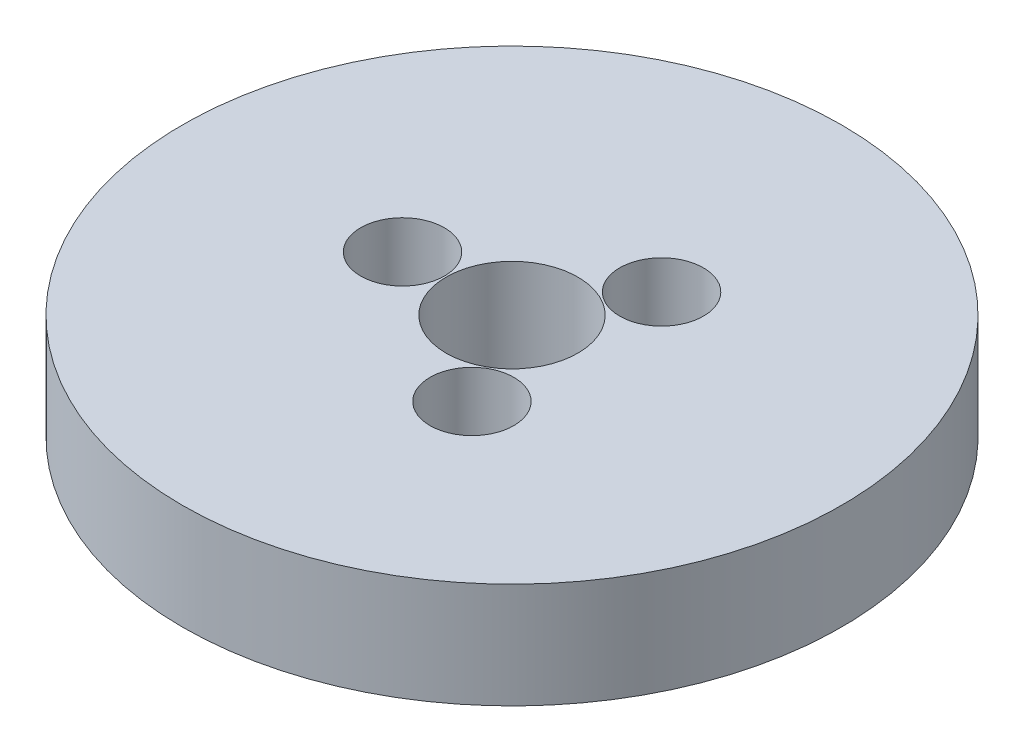
ISO-10303-21;
HEADER;
FILE_DESCRIPTION(('STEP AP214'),'2;1');
FILE_NAME('part.step','',(''),(''),'','','');
FILE_SCHEMA(('AUTOMOTIVE_DESIGN { 1 0 10303 214 1 1 1 1 }'));
ENDSEC;
DATA;
#1=APPLICATION_CONTEXT('core data for automotive mechanical design processes');
#2=APPLICATION_PROTOCOL_DEFINITION('international standard','automotive_design',2000,#1);
#3=PRODUCT_CONTEXT('',#1,'mechanical');
#4=PRODUCT('Part','Part','',(#3));
#5=PRODUCT_RELATED_PRODUCT_CATEGORY('part','',(#4));
#6=PRODUCT_DEFINITION_FORMATION('','',#4);
#7=PRODUCT_DEFINITION_CONTEXT('part definition',#1,'design');
#8=PRODUCT_DEFINITION('design','',#6,#7);
#9=PRODUCT_DEFINITION_SHAPE('','',#8);
#10=(LENGTH_UNIT() NAMED_UNIT(*) SI_UNIT(.MILLI.,.METRE.));
#11=(NAMED_UNIT(*) PLANE_ANGLE_UNIT() SI_UNIT($,.RADIAN.));
#12=(NAMED_UNIT(*) SI_UNIT($,.STERADIAN.) SOLID_ANGLE_UNIT());
#13=UNCERTAINTY_MEASURE_WITH_UNIT(LENGTH_MEASURE(1.E-05),#10,'distance_accuracy_value','');
#14=(GEOMETRIC_REPRESENTATION_CONTEXT(3) GLOBAL_UNCERTAINTY_ASSIGNED_CONTEXT((#13)) GLOBAL_UNIT_ASSIGNED_CONTEXT((#10,
#11,#12)) REPRESENTATION_CONTEXT('',''));
#15=CARTESIAN_POINT('',(0.,0.,0.));
#16=DIRECTION('',(0.,0.,1.));
#17=DIRECTION('',(1.,0.,0.));
#18=AXIS2_PLACEMENT_3D('',#15,#16,#17);
#19=CARTESIAN_POINT('',(0.,16.,0.));
#20=DIRECTION('',(0.,-1.,0.));
#21=DIRECTION('',(0.,0.,-1.));
#22=AXIS2_PLACEMENT_3D('',#19,#20,#21);
#23=CYLINDRICAL_SURFACE('',#22,50.);
#24=CARTESIAN_POINT('',(0.,16.,0.));
#25=DIRECTION('',(0.,1.,0.));
#26=DIRECTION('',(0.,0.,1.));
#27=AXIS2_PLACEMENT_3D('',#24,#25,#26);
#28=CIRCLE('',#27,50.);
#29=CARTESIAN_POINT('',(0.,16.,50.));
#30=VERTEX_POINT('',#29);
#31=EDGE_CURVE('E10',#30,#30,#28,.T.);
#32=ORIENTED_EDGE('',*,*,#31,.F.);
#33=EDGE_LOOP('',(#32));
#34=FACE_BOUND('',#33,.T.);
#35=CARTESIAN_POINT('',(0.,0.,0.));
#36=DIRECTION('',(0.,1.,0.));
#37=DIRECTION('',(0.,0.,1.));
#38=AXIS2_PLACEMENT_3D('',#35,#36,#37);
#39=CIRCLE('',#38,50.);
#40=CARTESIAN_POINT('',(0.,0.,50.));
#41=VERTEX_POINT('',#40);
#42=EDGE_CURVE('E37',#41,#41,#39,.T.);
#43=ORIENTED_EDGE('',*,*,#42,.T.);
#44=EDGE_LOOP('',(#43));
#45=FACE_BOUND('',#44,.T.);
#46=ADVANCED_FACE('F40',(#34,#45),#23,.T.);
#47=CARTESIAN_POINT('',(0.,16.,0.));
#48=DIRECTION('',(0.,1.,0.));
#49=DIRECTION('',(0.,0.,1.));
#50=AXIS2_PLACEMENT_3D('',#47,#48,#49);
#51=PLANE('',#50);
#52=CARTESIAN_POINT('',(8.30583592440204,16.,14.386129820395));
#53=DIRECTION('',(0.,1.,0.));
#54=DIRECTION('',(0.866025403784436,0.,-0.500000000000004));
#55=AXIS2_PLACEMENT_3D('',#52,#53,#54);
#56=CIRCLE('',#55,6.35538152838304);
#57=CARTESIAN_POINT('',(13.8097577787241,16.,11.2084390562035));
#58=VERTEX_POINT('',#57);
#59=EDGE_CURVE('E70',#58,#58,#56,.T.);
#60=ORIENTED_EDGE('',*,*,#59,.F.);
#61=EDGE_LOOP('',(#60));
#62=FACE_BOUND('',#61,.T.);
#63=CARTESIAN_POINT('',(8.30583592440184,16.,-14.3861298203951));
#64=DIRECTION('',(0.,1.,0.));
#65=DIRECTION('',(-0.866025403784443,0.,-0.499999999999992));
#66=AXIS2_PLACEMENT_3D('',#63,#64,#65);
#67=CIRCLE('',#66,6.35538152838304);
#68=CARTESIAN_POINT('',(2.80191407007973,16.,-17.5638205845866));
#69=VERTEX_POINT('',#68);
#70=EDGE_CURVE('E61',#69,#69,#67,.T.);
#71=ORIENTED_EDGE('',*,*,#70,.F.);
#72=EDGE_LOOP('',(#71));
#73=FACE_BOUND('',#72,.T.);
#74=CARTESIAN_POINT('',(-16.611671848804,16.,0.));
#75=DIRECTION('',(0.,1.,0.));
#76=DIRECTION('',(0.,0.,1.));
#77=AXIS2_PLACEMENT_3D('',#74,#75,#76);
#78=CIRCLE('',#77,6.35538152838304);
#79=CARTESIAN_POINT('',(-16.611671848804,16.,6.35538152838304));
#80=VERTEX_POINT('',#79);
#81=EDGE_CURVE('E54',#80,#80,#78,.T.);
#82=ORIENTED_EDGE('',*,*,#81,.F.);
#83=EDGE_LOOP('',(#82));
#84=FACE_BOUND('',#83,.T.);
#85=CARTESIAN_POINT('',(0.,16.,0.));
#86=DIRECTION('',(0.,1.,0.));
#87=DIRECTION('',(0.,0.,1.));
#88=AXIS2_PLACEMENT_3D('',#85,#86,#87);
#89=CIRCLE('',#88,10.);
#90=CARTESIAN_POINT('',(0.,16.,10.));
#91=VERTEX_POINT('',#90);
#92=EDGE_CURVE('E50',#91,#91,#89,.T.);
#93=ORIENTED_EDGE('',*,*,#92,.F.);
#94=EDGE_LOOP('',(#93));
#95=FACE_BOUND('',#94,.T.);
#96=ORIENTED_EDGE('',*,*,#31,.T.);
#97=EDGE_LOOP('',(#96));
#98=FACE_BOUND('',#97,.T.);
#99=ADVANCED_FACE('F85',(#62,#73,#84,#95,#98),#51,.T.);
#100=CARTESIAN_POINT('',(0.,0.,0.));
#101=DIRECTION('',(0.,1.,0.));
#102=DIRECTION('',(0.,0.,1.));
#103=AXIS2_PLACEMENT_3D('',#100,#101,#102);
#104=PLANE('',#103);
#105=CARTESIAN_POINT('',(0.,0.,0.));
#106=DIRECTION('',(0.,1.,0.));
#107=DIRECTION('',(0.,0.,1.));
#108=AXIS2_PLACEMENT_3D('',#105,#106,#107);
#109=CIRCLE('',#108,10.);
#110=CARTESIAN_POINT('',(0.,0.,10.));
#111=VERTEX_POINT('',#110);
#112=EDGE_CURVE('E47',#111,#111,#109,.T.);
#113=ORIENTED_EDGE('',*,*,#112,.T.);
#114=EDGE_LOOP('',(#113));
#115=FACE_BOUND('',#114,.T.);
#116=ORIENTED_EDGE('',*,*,#42,.F.);
#117=EDGE_LOOP('',(#116));
#118=FACE_BOUND('',#117,.T.);
#119=ADVANCED_FACE('F84',(#115,#118),#104,.F.);
#120=CARTESIAN_POINT('',(0.,16.,0.));
#121=DIRECTION('',(0.,-1.,0.));
#122=DIRECTION('',(0.,0.,-1.));
#123=AXIS2_PLACEMENT_3D('',#120,#121,#122);
#124=CYLINDRICAL_SURFACE('',#123,10.);
#125=ORIENTED_EDGE('',*,*,#92,.T.);
#126=EDGE_LOOP('',(#125));
#127=FACE_BOUND('',#126,.T.);
#128=ORIENTED_EDGE('',*,*,#112,.F.);
#129=EDGE_LOOP('',(#128));
#130=FACE_BOUND('',#129,.T.);
#131=ADVANCED_FACE('F91',(#127,#130),#124,.F.);
#132=CARTESIAN_POINT('',(-16.611671848804,4.77955471961071,0.));
#133=DIRECTION('',(0.,1.,0.));
#134=DIRECTION('',(0.,0.,1.));
#135=AXIS2_PLACEMENT_3D('',#132,#133,#134);
#136=CYLINDRICAL_SURFACE('',#135,6.35538152838304);
#137=CARTESIAN_POINT('',(-16.611671848804,4.77955471961071,0.));
#138=DIRECTION('',(0.,1.,0.));
#139=DIRECTION('',(0.,0.,1.));
#140=AXIS2_PLACEMENT_3D('',#137,#138,#139);
#141=CIRCLE('',#140,6.35538152838304);
#142=CARTESIAN_POINT('',(-16.611671848804,4.77955471961071,6.35538152838304));
#143=VERTEX_POINT('',#142);
#144=EDGE_CURVE('E55',#143,#143,#141,.T.);
#145=ORIENTED_EDGE('',*,*,#144,.F.);
#146=EDGE_LOOP('',(#145));
#147=FACE_BOUND('',#146,.T.);
#148=ORIENTED_EDGE('',*,*,#81,.T.);
#149=EDGE_LOOP('',(#148));
#150=FACE_BOUND('',#149,.T.);
#151=ADVANCED_FACE('F96',(#147,#150),#136,.F.);
#152=CARTESIAN_POINT('',(-16.611671848804,4.77955471961071,0.));
#153=DIRECTION('',(0.,1.,0.));
#154=DIRECTION('',(0.,0.,1.));
#155=AXIS2_PLACEMENT_3D('',#152,#153,#154);
#156=PLANE('',#155);
#157=ORIENTED_EDGE('',*,*,#144,.T.);
#158=EDGE_LOOP('',(#157));
#159=FACE_BOUND('',#158,.T.);
#160=ADVANCED_FACE('F127',(#159),#156,.T.);
#161=CARTESIAN_POINT('',(8.30583592440184,4.77955471961071,-14.3861298203951));
#162=DIRECTION('',(0.,1.,0.));
#163=DIRECTION('',(0.,0.,1.));
#164=AXIS2_PLACEMENT_3D('',#161,#162,#163);
#165=CYLINDRICAL_SURFACE('',#164,6.35538152838304);
#166=CARTESIAN_POINT('',(8.30583592440184,4.77955471961071,-14.3861298203951));
#167=DIRECTION('',(0.,1.,0.));
#168=DIRECTION('',(-0.866025403784443,0.,-0.499999999999992));
#169=AXIS2_PLACEMENT_3D('',#166,#167,#168);
#170=CIRCLE('',#169,6.35538152838304);
#171=CARTESIAN_POINT('',(2.80191407007973,4.77955471961071,-17.5638205845866));
#172=VERTEX_POINT('',#171);
#173=EDGE_CURVE('E63',#172,#172,#170,.T.);
#174=ORIENTED_EDGE('',*,*,#173,.F.);
#175=EDGE_LOOP('',(#174));
#176=FACE_BOUND('',#175,.T.);
#177=ORIENTED_EDGE('',*,*,#70,.T.);
#178=EDGE_LOOP('',(#177));
#179=FACE_BOUND('',#178,.T.);
#180=ADVANCED_FACE('F133',(#176,#179),#165,.F.);
#181=CARTESIAN_POINT('',(8.30583592440184,4.77955471961071,-14.3861298203951));
#182=DIRECTION('',(0.,1.,0.));
#183=DIRECTION('',(-0.866025403784443,0.,-0.499999999999992));
#184=AXIS2_PLACEMENT_3D('',#181,#182,#183);
#185=PLANE('',#184);
#186=ORIENTED_EDGE('',*,*,#173,.T.);
#187=EDGE_LOOP('',(#186));
#188=FACE_BOUND('',#187,.T.);
#189=ADVANCED_FACE('F77',(#188),#185,.T.);
#190=CARTESIAN_POINT('',(8.30583592440204,4.77955471961071,14.386129820395));
#191=DIRECTION('',(0.,1.,0.));
#192=DIRECTION('',(0.,0.,1.));
#193=AXIS2_PLACEMENT_3D('',#190,#191,#192);
#194=CYLINDRICAL_SURFACE('',#193,6.35538152838304);
#195=CARTESIAN_POINT('',(8.30583592440204,4.77955471961071,14.386129820395));
#196=DIRECTION('',(0.,1.,0.));
#197=DIRECTION('',(0.866025403784436,0.,-0.500000000000004));
#198=AXIS2_PLACEMENT_3D('',#195,#196,#197);
#199=CIRCLE('',#198,6.35538152838304);
#200=CARTESIAN_POINT('',(13.8097577787241,4.77955471961071,11.2084390562035));
#201=VERTEX_POINT('',#200);
#202=EDGE_CURVE('E59',#201,#201,#199,.T.);
#203=ORIENTED_EDGE('',*,*,#202,.F.);
#204=EDGE_LOOP('',(#203));
#205=FACE_BOUND('',#204,.T.);
#206=ORIENTED_EDGE('',*,*,#59,.T.);
#207=EDGE_LOOP('',(#206));
#208=FACE_BOUND('',#207,.T.);
#209=ADVANCED_FACE('F73',(#205,#208),#194,.F.);
#210=CARTESIAN_POINT('',(8.30583592440204,4.77955471961071,14.386129820395));
#211=DIRECTION('',(0.,1.,0.));
#212=DIRECTION('',(0.866025403784436,0.,-0.500000000000004));
#213=AXIS2_PLACEMENT_3D('',#210,#211,#212);
#214=PLANE('',#213);
#215=ORIENTED_EDGE('',*,*,#202,.T.);
#216=EDGE_LOOP('',(#215));
#217=FACE_BOUND('',#216,.T.);
#218=ADVANCED_FACE('F71',(#217),#214,.T.);
#219=CLOSED_SHELL('',(#46,#99,#119,#131,#151,#160,#180,#189,#209,#218));
#220=MANIFOLD_SOLID_BREP('B2',#219);
#221=ADVANCED_BREP_SHAPE_REPRESENTATION('',(#18,#220),#14);
#222=SHAPE_DEFINITION_REPRESENTATION(#9,#221);
ENDSEC;
END-ISO-10303-21;
